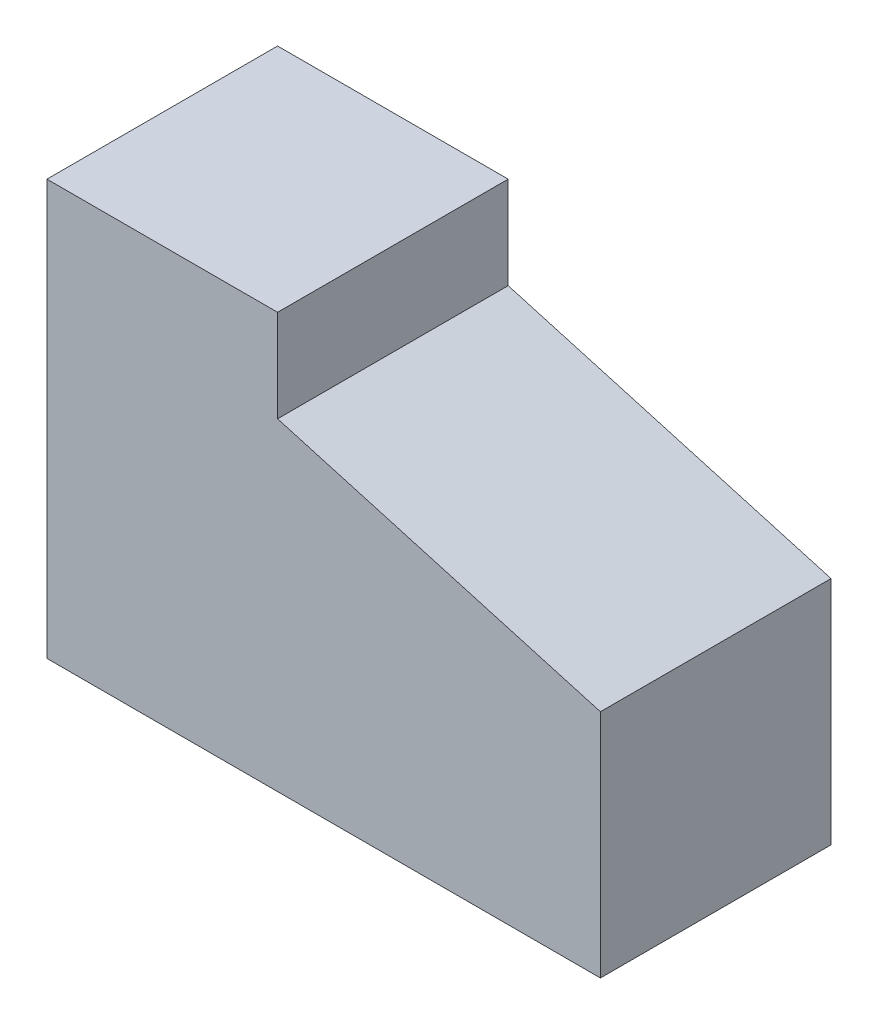
ISO-10303-21;
HEADER;
FILE_DESCRIPTION(('STEP AP214'),'2;1');
FILE_NAME('part.step','',(''),(''),'','','');
FILE_SCHEMA(('AUTOMOTIVE_DESIGN { 1 0 10303 214 1 1 1 1 }'));
ENDSEC;
DATA;
#1=APPLICATION_CONTEXT('core data for automotive mechanical design processes');
#2=APPLICATION_PROTOCOL_DEFINITION('international standard','automotive_design',2000,#1);
#3=PRODUCT_CONTEXT('',#1,'mechanical');
#4=PRODUCT('Part','Part','',(#3));
#5=PRODUCT_RELATED_PRODUCT_CATEGORY('part','',(#4));
#6=PRODUCT_DEFINITION_FORMATION('','',#4);
#7=PRODUCT_DEFINITION_CONTEXT('part definition',#1,'design');
#8=PRODUCT_DEFINITION('design','',#6,#7);
#9=PRODUCT_DEFINITION_SHAPE('','',#8);
#10=(LENGTH_UNIT() NAMED_UNIT(*) SI_UNIT(.MILLI.,.METRE.));
#11=(NAMED_UNIT(*) PLANE_ANGLE_UNIT() SI_UNIT($,.RADIAN.));
#12=(NAMED_UNIT(*) SI_UNIT($,.STERADIAN.) SOLID_ANGLE_UNIT());
#13=UNCERTAINTY_MEASURE_WITH_UNIT(LENGTH_MEASURE(1.E-05),#10,'distance_accuracy_value','');
#14=(GEOMETRIC_REPRESENTATION_CONTEXT(3) GLOBAL_UNCERTAINTY_ASSIGNED_CONTEXT((#13)) GLOBAL_UNIT_ASSIGNED_CONTEXT((#10,
#11,#12)) REPRESENTATION_CONTEXT('',''));
#15=CARTESIAN_POINT('',(0.,0.,0.));
#16=DIRECTION('',(0.,0.,1.));
#17=DIRECTION('',(1.,0.,0.));
#18=AXIS2_PLACEMENT_3D('',#15,#16,#17);
#19=CARTESIAN_POINT('',(0.,0.,127.));
#20=DIRECTION('',(1.,0.,0.));
#21=DIRECTION('',(0.,0.,-1.));
#22=AXIS2_PLACEMENT_3D('',#19,#20,#21);
#23=PLANE('',#22);
#24=DIRECTION('',(0.,-1.,0.));
#25=VECTOR('',#24,1.);
#26=CARTESIAN_POINT('',(0.,0.,0.));
#27=LINE('',#26,#25);
#28=CARTESIAN_POINT('',(0.,228.6,0.));
#29=VERTEX_POINT('',#28);
#30=CARTESIAN_POINT('',(0.,0.,0.));
#31=VERTEX_POINT('',#30);
#32=EDGE_CURVE('E117',#29,#31,#27,.T.);
#33=ORIENTED_EDGE('',*,*,#32,.T.);
#34=DIRECTION('',(0.,0.,-1.));
#35=VECTOR('',#34,1.);
#36=CARTESIAN_POINT('',(0.,0.,127.));
#37=LINE('',#36,#35);
#38=CARTESIAN_POINT('',(0.,0.,127.));
#39=VERTEX_POINT('',#38);
#40=EDGE_CURVE('E11',#39,#31,#37,.T.);
#41=ORIENTED_EDGE('',*,*,#40,.F.);
#42=DIRECTION('',(0.,-1.,0.));
#43=VECTOR('',#42,1.);
#44=CARTESIAN_POINT('',(0.,0.,127.));
#45=LINE('',#44,#43);
#46=CARTESIAN_POINT('',(0.,228.6,127.));
#47=VERTEX_POINT('',#46);
#48=EDGE_CURVE('E127',#47,#39,#45,.T.);
#49=ORIENTED_EDGE('',*,*,#48,.F.);
#50=DIRECTION('',(0.,0.,-1.));
#51=VECTOR('',#50,1.);
#52=CARTESIAN_POINT('',(0.,228.6,127.));
#53=LINE('',#52,#51);
#54=EDGE_CURVE('E113',#47,#29,#53,.T.);
#55=ORIENTED_EDGE('',*,*,#54,.T.);
#56=EDGE_LOOP('',(#33,#41,#49,#55));
#57=FACE_BOUND('',#56,.T.);
#58=ADVANCED_FACE('F33',(#57),#23,.F.);
#59=CARTESIAN_POINT('',(0.,0.,127.));
#60=DIRECTION('',(0.,1.,0.));
#61=DIRECTION('',(0.,0.,1.));
#62=AXIS2_PLACEMENT_3D('',#59,#60,#61);
#63=PLANE('',#62);
#64=DIRECTION('',(1.,0.,0.));
#65=VECTOR('',#64,1.);
#66=CARTESIAN_POINT('',(0.,0.,0.));
#67=LINE('',#66,#65);
#68=CARTESIAN_POINT('',(304.8,0.,0.));
#69=VERTEX_POINT('',#68);
#70=EDGE_CURVE('E120',#31,#69,#67,.T.);
#71=ORIENTED_EDGE('',*,*,#70,.T.);
#72=DIRECTION('',(0.,0.,-1.));
#73=VECTOR('',#72,1.);
#74=CARTESIAN_POINT('',(304.8,0.,127.));
#75=LINE('',#74,#73);
#76=CARTESIAN_POINT('',(304.8,0.,127.));
#77=VERTEX_POINT('',#76);
#78=EDGE_CURVE('E41',#77,#69,#75,.T.);
#79=ORIENTED_EDGE('',*,*,#78,.F.);
#80=DIRECTION('',(1.,0.,0.));
#81=VECTOR('',#80,1.);
#82=CARTESIAN_POINT('',(0.,0.,127.));
#83=LINE('',#82,#81);
#84=EDGE_CURVE('E86',#39,#77,#83,.T.);
#85=ORIENTED_EDGE('',*,*,#84,.F.);
#86=ORIENTED_EDGE('',*,*,#40,.T.);
#87=EDGE_LOOP('',(#71,#79,#85,#86));
#88=FACE_BOUND('',#87,.T.);
#89=ADVANCED_FACE('F151',(#88),#63,.F.);
#90=CARTESIAN_POINT('',(304.8,0.,127.));
#91=DIRECTION('',(-1.,0.,0.));
#92=DIRECTION('',(0.,0.,1.));
#93=AXIS2_PLACEMENT_3D('',#90,#91,#92);
#94=PLANE('',#93);
#95=DIRECTION('',(0.,1.,0.));
#96=VECTOR('',#95,1.);
#97=CARTESIAN_POINT('',(304.8,0.,0.));
#98=LINE('',#97,#96);
#99=CARTESIAN_POINT('',(304.8,127.,0.));
#100=VERTEX_POINT('',#99);
#101=EDGE_CURVE('E122',#69,#100,#98,.T.);
#102=ORIENTED_EDGE('',*,*,#101,.T.);
#103=DIRECTION('',(0.,0.,-1.));
#104=VECTOR('',#103,1.);
#105=CARTESIAN_POINT('',(304.8,127.,127.));
#106=LINE('',#105,#104);
#107=CARTESIAN_POINT('',(304.8,127.,127.));
#108=VERTEX_POINT('',#107);
#109=EDGE_CURVE('E108',#108,#100,#106,.T.);
#110=ORIENTED_EDGE('',*,*,#109,.F.);
#111=DIRECTION('',(0.,1.,0.));
#112=VECTOR('',#111,1.);
#113=CARTESIAN_POINT('',(304.8,0.,127.));
#114=LINE('',#113,#112);
#115=EDGE_CURVE('E99',#77,#108,#114,.T.);
#116=ORIENTED_EDGE('',*,*,#115,.F.);
#117=ORIENTED_EDGE('',*,*,#78,.T.);
#118=EDGE_LOOP('',(#102,#110,#116,#117));
#119=FACE_BOUND('',#118,.T.);
#120=ADVANCED_FACE('F133',(#119),#94,.F.);
#121=CARTESIAN_POINT('',(127.,177.8,127.));
#122=DIRECTION('',(-0.274721127897378,-0.961523947640823,0.));
#123=DIRECTION('',(0.961523947640823,-0.274721127897378,0.));
#124=AXIS2_PLACEMENT_3D('',#121,#122,#123);
#125=PLANE('',#124);
#126=DIRECTION('',(-0.961523947640823,0.274721127897378,0.));
#127=VECTOR('',#126,1.);
#128=CARTESIAN_POINT('',(127.,177.8,0.));
#129=LINE('',#128,#127);
#130=CARTESIAN_POINT('',(127.,177.8,0.));
#131=VERTEX_POINT('',#130);
#132=EDGE_CURVE('E107',#100,#131,#129,.T.);
#133=ORIENTED_EDGE('',*,*,#132,.T.);
#134=DIRECTION('',(0.,0.,-1.));
#135=VECTOR('',#134,1.);
#136=CARTESIAN_POINT('',(127.,177.8,127.));
#137=LINE('',#136,#135);
#138=CARTESIAN_POINT('',(127.,177.8,127.));
#139=VERTEX_POINT('',#138);
#140=EDGE_CURVE('E104',#139,#131,#137,.T.);
#141=ORIENTED_EDGE('',*,*,#140,.F.);
#142=DIRECTION('',(-0.961523947640823,0.274721127897378,0.));
#143=VECTOR('',#142,1.);
#144=CARTESIAN_POINT('',(127.,177.8,127.));
#145=LINE('',#144,#143);
#146=EDGE_CURVE('E93',#108,#139,#145,.T.);
#147=ORIENTED_EDGE('',*,*,#146,.F.);
#148=ORIENTED_EDGE('',*,*,#109,.T.);
#149=EDGE_LOOP('',(#133,#141,#147,#148));
#150=FACE_BOUND('',#149,.T.);
#151=ADVANCED_FACE('F105',(#150),#125,.F.);
#152=CARTESIAN_POINT('',(127.,228.6,127.));
#153=DIRECTION('',(-1.,0.,0.));
#154=DIRECTION('',(0.,0.,1.));
#155=AXIS2_PLACEMENT_3D('',#152,#153,#154);
#156=PLANE('',#155);
#157=DIRECTION('',(0.,1.,0.));
#158=VECTOR('',#157,1.);
#159=CARTESIAN_POINT('',(127.,228.6,0.));
#160=LINE('',#159,#158);
#161=CARTESIAN_POINT('',(127.,228.6,0.));
#162=VERTEX_POINT('',#161);
#163=EDGE_CURVE('E72',#131,#162,#160,.T.);
#164=ORIENTED_EDGE('',*,*,#163,.T.);
#165=DIRECTION('',(0.,0.,-1.));
#166=VECTOR('',#165,1.);
#167=CARTESIAN_POINT('',(127.,228.6,127.));
#168=LINE('',#167,#166);
#169=CARTESIAN_POINT('',(127.,228.6,127.));
#170=VERTEX_POINT('',#169);
#171=EDGE_CURVE('E109',#170,#162,#168,.T.);
#172=ORIENTED_EDGE('',*,*,#171,.F.);
#173=DIRECTION('',(0.,1.,0.));
#174=VECTOR('',#173,1.);
#175=CARTESIAN_POINT('',(127.,228.6,127.));
#176=LINE('',#175,#174);
#177=EDGE_CURVE('E97',#139,#170,#176,.T.);
#178=ORIENTED_EDGE('',*,*,#177,.F.);
#179=ORIENTED_EDGE('',*,*,#140,.T.);
#180=EDGE_LOOP('',(#164,#172,#178,#179));
#181=FACE_BOUND('',#180,.T.);
#182=ADVANCED_FACE('F111',(#181),#156,.F.);
#183=CARTESIAN_POINT('',(0.,228.6,127.));
#184=DIRECTION('',(0.,-1.,0.));
#185=DIRECTION('',(0.,0.,-1.));
#186=AXIS2_PLACEMENT_3D('',#183,#184,#185);
#187=PLANE('',#186);
#188=DIRECTION('',(-1.,0.,0.));
#189=VECTOR('',#188,1.);
#190=CARTESIAN_POINT('',(0.,228.6,0.));
#191=LINE('',#190,#189);
#192=EDGE_CURVE('E78',#162,#29,#191,.T.);
#193=ORIENTED_EDGE('',*,*,#192,.T.);
#194=ORIENTED_EDGE('',*,*,#54,.F.);
#195=DIRECTION('',(-1.,0.,0.));
#196=VECTOR('',#195,1.);
#197=CARTESIAN_POINT('',(0.,228.6,127.));
#198=LINE('',#197,#196);
#199=EDGE_CURVE('E49',#170,#47,#198,.T.);
#200=ORIENTED_EDGE('',*,*,#199,.F.);
#201=ORIENTED_EDGE('',*,*,#171,.T.);
#202=EDGE_LOOP('',(#193,#194,#200,#201));
#203=FACE_BOUND('',#202,.T.);
#204=ADVANCED_FACE('F140',(#203),#187,.F.);
#205=CARTESIAN_POINT('',(0.,0.,127.));
#206=DIRECTION('',(0.,0.,-1.));
#207=DIRECTION('',(-1.,0.,0.));
#208=AXIS2_PLACEMENT_3D('',#205,#206,#207);
#209=PLANE('',#208);
#210=ORIENTED_EDGE('',*,*,#48,.T.);
#211=ORIENTED_EDGE('',*,*,#84,.T.);
#212=ORIENTED_EDGE('',*,*,#115,.T.);
#213=ORIENTED_EDGE('',*,*,#146,.T.);
#214=ORIENTED_EDGE('',*,*,#177,.T.);
#215=ORIENTED_EDGE('',*,*,#199,.T.);
#216=EDGE_LOOP('',(#210,#211,#212,#213,#214,#215));
#217=FACE_BOUND('',#216,.T.);
#218=ADVANCED_FACE('F95',(#217),#209,.F.);
#219=CARTESIAN_POINT('',(0.,0.,0.));
#220=DIRECTION('',(0.,0.,-1.));
#221=DIRECTION('',(-1.,0.,0.));
#222=AXIS2_PLACEMENT_3D('',#219,#220,#221);
#223=PLANE('',#222);
#224=ORIENTED_EDGE('',*,*,#32,.F.);
#225=ORIENTED_EDGE('',*,*,#192,.F.);
#226=ORIENTED_EDGE('',*,*,#163,.F.);
#227=ORIENTED_EDGE('',*,*,#132,.F.);
#228=ORIENTED_EDGE('',*,*,#101,.F.);
#229=ORIENTED_EDGE('',*,*,#70,.F.);
#230=EDGE_LOOP('',(#224,#225,#226,#227,#228,#229));
#231=FACE_BOUND('',#230,.T.);
#232=ADVANCED_FACE('F136',(#231),#223,.T.);
#233=CLOSED_SHELL('',(#58,#89,#120,#151,#182,#204,#218,#232));
#234=MANIFOLD_SOLID_BREP('B2',#233);
#235=ADVANCED_BREP_SHAPE_REPRESENTATION('',(#18,#234),#14);
#236=SHAPE_DEFINITION_REPRESENTATION(#9,#235);
ENDSEC;
END-ISO-10303-21;
